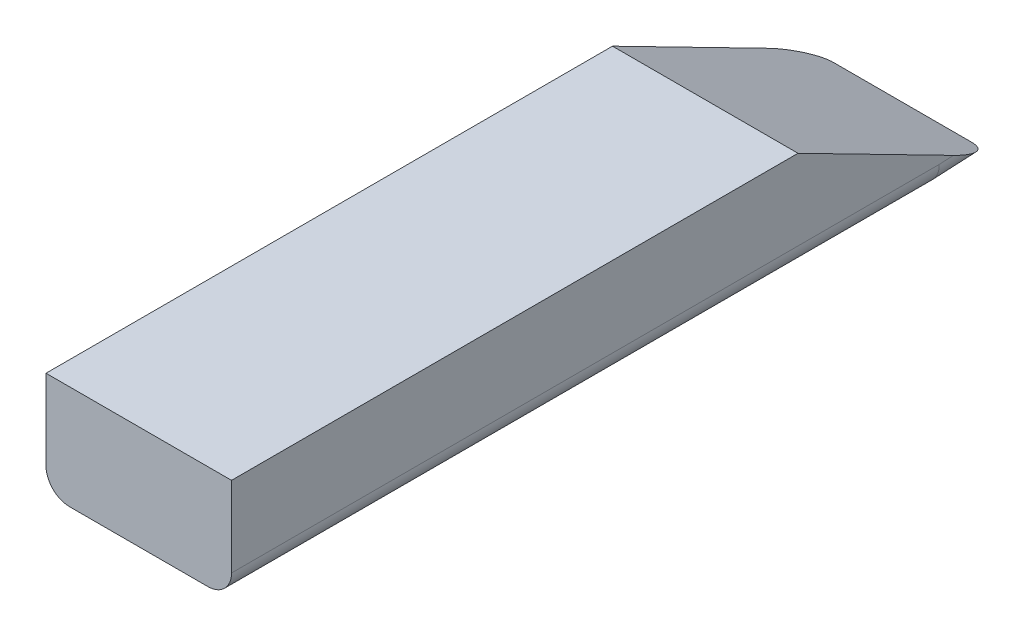
ISO-10303-21;
HEADER;
FILE_DESCRIPTION(('STEP AP214'),'2;1');
FILE_NAME('part.step','',(''),(''),'','','');
FILE_SCHEMA(('AUTOMOTIVE_DESIGN { 1 0 10303 214 1 1 1 1 }'));
ENDSEC;
DATA;
#1=APPLICATION_CONTEXT('core data for automotive mechanical design processes');
#2=APPLICATION_PROTOCOL_DEFINITION('international standard','automotive_design',2000,#1);
#3=PRODUCT_CONTEXT('',#1,'mechanical');
#4=PRODUCT('Part','Part','',(#3));
#5=PRODUCT_RELATED_PRODUCT_CATEGORY('part','',(#4));
#6=PRODUCT_DEFINITION_FORMATION('','',#4);
#7=PRODUCT_DEFINITION_CONTEXT('part definition',#1,'design');
#8=PRODUCT_DEFINITION('design','',#6,#7);
#9=PRODUCT_DEFINITION_SHAPE('','',#8);
#10=(LENGTH_UNIT() NAMED_UNIT(*) SI_UNIT(.MILLI.,.METRE.));
#11=(NAMED_UNIT(*) PLANE_ANGLE_UNIT() SI_UNIT($,.RADIAN.));
#12=(NAMED_UNIT(*) SI_UNIT($,.STERADIAN.) SOLID_ANGLE_UNIT());
#13=UNCERTAINTY_MEASURE_WITH_UNIT(LENGTH_MEASURE(1.E-05),#10,'distance_accuracy_value','');
#14=(GEOMETRIC_REPRESENTATION_CONTEXT(3) GLOBAL_UNCERTAINTY_ASSIGNED_CONTEXT((#13)) GLOBAL_UNIT_ASSIGNED_CONTEXT((#10,
#11,#12)) REPRESENTATION_CONTEXT('',''));
#15=CARTESIAN_POINT('',(0.,0.,0.));
#16=DIRECTION('',(0.,0.,1.));
#17=DIRECTION('',(1.,0.,0.));
#18=AXIS2_PLACEMENT_3D('',#15,#16,#17);
#19=CARTESIAN_POINT('',(49.911,0.,-381.1016));
#20=DIRECTION('',(0.,1.,0.));
#21=DIRECTION('',(0.,0.,1.));
#22=AXIS2_PLACEMENT_3D('',#19,#20,#21);
#23=PLANE('',#22);
#24=DIRECTION('',(-1.,0.,0.));
#25=VECTOR('',#24,1.);
#26=CARTESIAN_POINT('',(49.911,0.,0.));
#27=LINE('',#26,#25);
#28=CARTESIAN_POINT('',(37.211,0.,0.));
#29=VERTEX_POINT('',#28);
#30=CARTESIAN_POINT('',(-37.211,0.,0.));
#31=VERTEX_POINT('',#30);
#32=EDGE_CURVE('E144',#29,#31,#27,.T.);
#33=ORIENTED_EDGE('',*,*,#32,.T.);
#34=DIRECTION('',(0.,0.,-1.));
#35=VECTOR('',#34,1.);
#36=CARTESIAN_POINT('',(-37.211,0.,-381.1016));
#37=LINE('',#36,#35);
#38=CARTESIAN_POINT('',(-37.211,0.,-381.1016));
#39=VERTEX_POINT('',#38);
#40=EDGE_CURVE('E192',#31,#39,#37,.T.);
#41=ORIENTED_EDGE('',*,*,#40,.T.);
#42=DIRECTION('',(-1.,0.,0.));
#43=VECTOR('',#42,1.);
#44=CARTESIAN_POINT('',(49.911,0.,-381.1016));
#45=LINE('',#44,#43);
#46=CARTESIAN_POINT('',(37.211,0.,-381.1016));
#47=VERTEX_POINT('',#46);
#48=EDGE_CURVE('E162',#47,#39,#45,.T.);
#49=ORIENTED_EDGE('',*,*,#48,.F.);
#50=DIRECTION('',(0.,0.,-1.));
#51=VECTOR('',#50,1.);
#52=CARTESIAN_POINT('',(37.211,0.,-381.1016));
#53=LINE('',#52,#51);
#54=EDGE_CURVE('E68',#47,#29,#53,.F.);
#55=ORIENTED_EDGE('',*,*,#54,.T.);
#56=EDGE_LOOP('',(#33,#41,#49,#55));
#57=FACE_BOUND('',#56,.T.);
#58=ADVANCED_FACE('F45',(#57),#23,.F.);
#59=CARTESIAN_POINT('',(49.911,1.51640056220143,-411.035788296217));
#60=DIRECTION('',(0.,0.998719357184186,0.0505929400767125));
#61=DIRECTION('',(0.,-0.0505929400767125,0.998719357184186));
#62=AXIS2_PLACEMENT_3D('',#59,#60,#61);
#63=PLANE('',#62);
#64=DIRECTION('',(-1.,0.,0.));
#65=VECTOR('',#64,1.);
#66=CARTESIAN_POINT('',(49.911,1.51640056220143,-411.035788296217));
#67=LINE('',#66,#65);
#68=CARTESIAN_POINT('',(37.211,1.51640056220143,-411.035788296217));
#69=VERTEX_POINT('',#68);
#70=CARTESIAN_POINT('',(-37.211,1.51640056220143,-411.035788296217));
#71=VERTEX_POINT('',#70);
#72=EDGE_CURVE('E134',#69,#71,#67,.T.);
#73=ORIENTED_EDGE('',*,*,#72,.F.);
#74=DIRECTION('',(0.,0.0505929400767125,-0.998719357184186));
#75=VECTOR('',#74,1.);
#76=CARTESIAN_POINT('',(37.211,1.51640056220143,-411.035788296217));
#77=LINE('',#76,#75);
#78=EDGE_CURVE('E181',#69,#47,#77,.F.);
#79=ORIENTED_EDGE('',*,*,#78,.T.);
#80=ORIENTED_EDGE('',*,*,#48,.T.);
#81=DIRECTION('',(0.,0.0505929400767125,-0.998719357184186));
#82=VECTOR('',#81,1.);
#83=CARTESIAN_POINT('',(-37.211,1.51640056220143,-411.035788296217));
#84=LINE('',#83,#82);
#85=EDGE_CURVE('E177',#39,#71,#84,.T.);
#86=ORIENTED_EDGE('',*,*,#85,.T.);
#87=EDGE_LOOP('',(#73,#79,#80,#86));
#88=FACE_BOUND('',#87,.T.);
#89=ADVANCED_FACE('F222',(#88),#63,.F.);
#90=CARTESIAN_POINT('',(49.911,55.88,-304.8));
#91=DIRECTION('',(0.,-0.89021280461113,0.455544907233509));
#92=DIRECTION('',(0.,-0.455544907233509,-0.89021280461113));
#93=AXIS2_PLACEMENT_3D('',#90,#91,#92);
#94=PLANE('',#93);
#95=DIRECTION('',(0.,0.455544907233509,0.89021280461113));
#96=VECTOR('',#95,1.);
#97=CARTESIAN_POINT('',(49.911,55.88,-304.8));
#98=LINE('',#97,#96);
#99=CARTESIAN_POINT('',(49.911,13.0872412059327,-388.424383059094));
#100=VERTEX_POINT('',#99);
#101=CARTESIAN_POINT('',(49.911,55.88,-304.8));
#102=VERTEX_POINT('',#101);
#103=EDGE_CURVE('E113',#100,#102,#98,.T.);
#104=ORIENTED_EDGE('',*,*,#103,.F.);
#105=CARTESIAN_POINT('',(37.211,13.0872412059327,-388.424383059094));
#106=DIRECTION('',(0.,-0.89021280461113,0.455544907233509));
#107=DIRECTION('',(0.,-0.455544907233509,-0.89021280461113));
#108=AXIS2_PLACEMENT_3D('',#105,#106,#107);
#109=ELLIPSE('',#108,25.4000000000003,12.7);
#110=EDGE_CURVE('E174',#100,#69,#109,.F.);
#111=ORIENTED_EDGE('',*,*,#110,.T.);
#112=ORIENTED_EDGE('',*,*,#72,.T.);
#113=CARTESIAN_POINT('',(-37.211,13.0872412059327,-388.424383059094));
#114=DIRECTION('',(0.,-0.89021280461113,0.455544907233509));
#115=DIRECTION('',(0.,0.455544907233509,0.89021280461113));
#116=AXIS2_PLACEMENT_3D('',#113,#114,#115);
#117=ELLIPSE('',#116,25.4000000000003,12.7);
#118=CARTESIAN_POINT('',(-49.911,13.0872412059327,-388.424383059094));
#119=VERTEX_POINT('',#118);
#120=EDGE_CURVE('E171',#71,#119,#117,.F.);
#121=ORIENTED_EDGE('',*,*,#120,.T.);
#122=DIRECTION('',(0.,0.455544907233509,0.89021280461113));
#123=VECTOR('',#122,1.);
#124=CARTESIAN_POINT('',(-49.911,55.88,-304.8));
#125=LINE('',#124,#123);
#126=CARTESIAN_POINT('',(-49.911,55.88,-304.8));
#127=VERTEX_POINT('',#126);
#128=EDGE_CURVE('E130',#119,#127,#125,.T.);
#129=ORIENTED_EDGE('',*,*,#128,.T.);
#130=DIRECTION('',(-1.,0.,0.));
#131=VECTOR('',#130,1.);
#132=CARTESIAN_POINT('',(49.911,55.88,-304.8));
#133=LINE('',#132,#131);
#134=EDGE_CURVE('E127',#102,#127,#133,.T.);
#135=ORIENTED_EDGE('',*,*,#134,.F.);
#136=EDGE_LOOP('',(#104,#111,#112,#121,#129,#135));
#137=FACE_BOUND('',#136,.T.);
#138=ADVANCED_FACE('F128',(#137),#94,.F.);
#139=CARTESIAN_POINT('',(49.911,55.88,0.));
#140=DIRECTION('',(0.,-1.,0.));
#141=DIRECTION('',(0.,0.,-1.));
#142=AXIS2_PLACEMENT_3D('',#139,#140,#141);
#143=PLANE('',#142);
#144=DIRECTION('',(0.,0.,1.));
#145=VECTOR('',#144,1.);
#146=CARTESIAN_POINT('',(-49.911,55.88,0.));
#147=LINE('',#146,#145);
#148=CARTESIAN_POINT('',(-49.911,55.88,0.));
#149=VERTEX_POINT('',#148);
#150=EDGE_CURVE('E149',#127,#149,#147,.T.);
#151=ORIENTED_EDGE('',*,*,#150,.T.);
#152=DIRECTION('',(-1.,0.,0.));
#153=VECTOR('',#152,1.);
#154=CARTESIAN_POINT('',(49.911,55.88,0.));
#155=LINE('',#154,#153);
#156=CARTESIAN_POINT('',(49.911,55.88,0.));
#157=VERTEX_POINT('',#156);
#158=EDGE_CURVE('E135',#157,#149,#155,.T.);
#159=ORIENTED_EDGE('',*,*,#158,.F.);
#160=DIRECTION('',(0.,0.,1.));
#161=VECTOR('',#160,1.);
#162=CARTESIAN_POINT('',(49.911,55.88,0.));
#163=LINE('',#162,#161);
#164=EDGE_CURVE('E118',#102,#157,#163,.T.);
#165=ORIENTED_EDGE('',*,*,#164,.F.);
#166=ORIENTED_EDGE('',*,*,#134,.T.);
#167=EDGE_LOOP('',(#151,#159,#165,#166));
#168=FACE_BOUND('',#167,.T.);
#169=ADVANCED_FACE('F137',(#168),#143,.F.);
#170=CARTESIAN_POINT('',(49.911,0.,0.));
#171=DIRECTION('',(0.,0.,-1.));
#172=DIRECTION('',(-1.,0.,0.));
#173=AXIS2_PLACEMENT_3D('',#170,#171,#172);
#174=PLANE('',#173);
#175=DIRECTION('',(0.,-1.,0.));
#176=VECTOR('',#175,1.);
#177=CARTESIAN_POINT('',(-49.911,0.,0.));
#178=LINE('',#177,#176);
#179=CARTESIAN_POINT('',(-49.911,12.7,0.));
#180=VERTEX_POINT('',#179);
#181=EDGE_CURVE('E124',#149,#180,#178,.T.);
#182=ORIENTED_EDGE('',*,*,#181,.T.);
#183=CARTESIAN_POINT('',(-37.211,12.7,0.));
#184=DIRECTION('',(0.,0.,-1.));
#185=DIRECTION('',(-1.,0.,0.));
#186=AXIS2_PLACEMENT_3D('',#183,#184,#185);
#187=CIRCLE('',#186,12.7);
#188=EDGE_CURVE('E11',#180,#31,#187,.F.);
#189=ORIENTED_EDGE('',*,*,#188,.T.);
#190=ORIENTED_EDGE('',*,*,#32,.F.);
#191=CARTESIAN_POINT('',(37.211,12.7,0.));
#192=DIRECTION('',(0.,0.,-1.));
#193=DIRECTION('',(-1.,0.,0.));
#194=AXIS2_PLACEMENT_3D('',#191,#192,#193);
#195=CIRCLE('',#194,12.7);
#196=CARTESIAN_POINT('',(49.911,12.7,0.));
#197=VERTEX_POINT('',#196);
#198=EDGE_CURVE('E55',#29,#197,#195,.F.);
#199=ORIENTED_EDGE('',*,*,#198,.T.);
#200=DIRECTION('',(0.,-1.,0.));
#201=VECTOR('',#200,1.);
#202=CARTESIAN_POINT('',(49.911,0.,0.));
#203=LINE('',#202,#201);
#204=EDGE_CURVE('E141',#157,#197,#203,.T.);
#205=ORIENTED_EDGE('',*,*,#204,.F.);
#206=ORIENTED_EDGE('',*,*,#158,.T.);
#207=EDGE_LOOP('',(#182,#189,#190,#199,#205,#206));
#208=FACE_BOUND('',#207,.T.);
#209=ADVANCED_FACE('F214',(#208),#174,.F.);
#210=CARTESIAN_POINT('',(49.911,0.,0.));
#211=DIRECTION('',(-1.,0.,0.));
#212=DIRECTION('',(0.,0.,1.));
#213=AXIS2_PLACEMENT_3D('',#210,#211,#212);
#214=PLANE('',#213);
#215=DIRECTION('',(0.,0.,-1.));
#216=VECTOR('',#215,1.);
#217=CARTESIAN_POINT('',(49.911,12.7,0.));
#218=LINE('',#217,#216);
#219=CARTESIAN_POINT('',(49.911,12.7,-380.78012898574));
#220=VERTEX_POINT('',#219);
#221=EDGE_CURVE('E166',#197,#220,#218,.T.);
#222=ORIENTED_EDGE('',*,*,#221,.T.);
#223=DIRECTION('',(0.,0.0505929400767125,-0.998719357184186));
#224=VECTOR('',#223,1.);
#225=CARTESIAN_POINT('',(49.911,-6.57262243700866,-0.332954689133065));
#226=LINE('',#225,#224);
#227=EDGE_CURVE('E121',#220,#100,#226,.T.);
#228=ORIENTED_EDGE('',*,*,#227,.T.);
#229=ORIENTED_EDGE('',*,*,#103,.T.);
#230=ORIENTED_EDGE('',*,*,#164,.T.);
#231=ORIENTED_EDGE('',*,*,#204,.T.);
#232=EDGE_LOOP('',(#222,#228,#229,#230,#231));
#233=FACE_BOUND('',#232,.T.);
#234=ADVANCED_FACE('F115',(#233),#214,.F.);
#235=CARTESIAN_POINT('',(-49.911,0.,0.));
#236=DIRECTION('',(-1.,0.,0.));
#237=DIRECTION('',(0.,0.,1.));
#238=AXIS2_PLACEMENT_3D('',#235,#236,#237);
#239=PLANE('',#238);
#240=ORIENTED_EDGE('',*,*,#128,.F.);
#241=DIRECTION('',(0.,0.0505929400767125,-0.998719357184186));
#242=VECTOR('',#241,1.);
#243=CARTESIAN_POINT('',(-49.911,12.6837358362392,-380.459069661026));
#244=LINE('',#243,#242);
#245=CARTESIAN_POINT('',(-49.911,12.7,-380.78012898574));
#246=VERTEX_POINT('',#245);
#247=EDGE_CURVE('E187',#119,#246,#244,.F.);
#248=ORIENTED_EDGE('',*,*,#247,.T.);
#249=DIRECTION('',(0.,0.,-1.));
#250=VECTOR('',#249,1.);
#251=CARTESIAN_POINT('',(-49.911,12.7,0.));
#252=LINE('',#251,#250);
#253=EDGE_CURVE('E184',#246,#180,#252,.F.);
#254=ORIENTED_EDGE('',*,*,#253,.T.);
#255=ORIENTED_EDGE('',*,*,#181,.F.);
#256=ORIENTED_EDGE('',*,*,#150,.F.);
#257=EDGE_LOOP('',(#240,#248,#254,#255,#256));
#258=FACE_BOUND('',#257,.T.);
#259=ADVANCED_FACE('F213',(#258),#239,.T.);
#260=CARTESIAN_POINT('',(37.211,12.7,0.));
#261=DIRECTION('',(0.,0.,-1.));
#262=DIRECTION('',(0.,1.,0.));
#263=AXIS2_PLACEMENT_3D('',#260,#261,#262);
#264=CYLINDRICAL_SURFACE('',#263,12.7);
#265=ORIENTED_EDGE('',*,*,#198,.F.);
#266=ORIENTED_EDGE('',*,*,#54,.F.);
#267=CARTESIAN_POINT('',(37.211,12.7,-380.78012898574));
#268=DIRECTION('',(0.,0.0253045728655293,-0.999679788028193));
#269=DIRECTION('',(0.,-0.999679788028193,-0.0253045728655291));
#270=AXIS2_PLACEMENT_3D('',#267,#268,#269);
#271=ELLIPSE('',#270,12.7040679946625,12.7);
#272=EDGE_CURVE('E150',#220,#47,#271,.T.);
#273=ORIENTED_EDGE('',*,*,#272,.F.);
#274=ORIENTED_EDGE('',*,*,#221,.F.);
#275=EDGE_LOOP('',(#265,#266,#273,#274));
#276=FACE_BOUND('',#275,.T.);
#277=ADVANCED_FACE('F218',(#276),#264,.T.);
#278=CARTESIAN_POINT('',(37.211,-6.57262243700866,-0.332954689133065));
#279=DIRECTION('',(0.,0.0505929400767125,-0.998719357184186));
#280=DIRECTION('',(0.,0.998719357184186,0.0505929400767125));
#281=AXIS2_PLACEMENT_3D('',#278,#279,#280);
#282=CYLINDRICAL_SURFACE('',#281,12.7);
#283=ORIENTED_EDGE('',*,*,#272,.T.);
#284=ORIENTED_EDGE('',*,*,#78,.F.);
#285=ORIENTED_EDGE('',*,*,#110,.F.);
#286=ORIENTED_EDGE('',*,*,#227,.F.);
#287=EDGE_LOOP('',(#283,#284,#285,#286));
#288=FACE_BOUND('',#287,.T.);
#289=ADVANCED_FACE('F219',(#288),#282,.T.);
#290=CARTESIAN_POINT('',(-37.211,12.7,-381.1016));
#291=DIRECTION('',(0.,0.,1.));
#292=DIRECTION('',(0.,-1.,0.));
#293=AXIS2_PLACEMENT_3D('',#290,#291,#292);
#294=CYLINDRICAL_SURFACE('',#293,12.7);
#295=ORIENTED_EDGE('',*,*,#188,.F.);
#296=ORIENTED_EDGE('',*,*,#253,.F.);
#297=CARTESIAN_POINT('',(-37.211,12.7,-380.78012898574));
#298=DIRECTION('',(0.,-0.0253045728655293,0.999679788028193));
#299=DIRECTION('',(0.,0.999679788028193,0.0253045728655291));
#300=AXIS2_PLACEMENT_3D('',#297,#298,#299);
#301=ELLIPSE('',#300,12.7040679946625,12.7);
#302=EDGE_CURVE('E49',#39,#246,#301,.F.);
#303=ORIENTED_EDGE('',*,*,#302,.F.);
#304=ORIENTED_EDGE('',*,*,#40,.F.);
#305=EDGE_LOOP('',(#295,#296,#303,#304));
#306=FACE_BOUND('',#305,.T.);
#307=ADVANCED_FACE('F47',(#306),#294,.T.);
#308=CARTESIAN_POINT('',(-37.211,14.2001363984406,-410.393257957242));
#309=DIRECTION('',(0.,-0.0505929400767125,0.998719357184186));
#310=DIRECTION('',(0.,-0.998719357184186,-0.0505929400767125));
#311=AXIS2_PLACEMENT_3D('',#308,#309,#310);
#312=CYLINDRICAL_SURFACE('',#311,12.7);
#313=ORIENTED_EDGE('',*,*,#302,.T.);
#314=ORIENTED_EDGE('',*,*,#247,.F.);
#315=ORIENTED_EDGE('',*,*,#120,.F.);
#316=ORIENTED_EDGE('',*,*,#85,.F.);
#317=EDGE_LOOP('',(#313,#314,#315,#316));
#318=FACE_BOUND('',#317,.T.);
#319=ADVANCED_FACE('F207',(#318),#312,.T.);
#320=CLOSED_SHELL('',(#58,#89,#138,#169,#209,#234,#259,#277,#289,#307,#319));
#321=MANIFOLD_SOLID_BREP('B2',#320);
#322=ADVANCED_BREP_SHAPE_REPRESENTATION('',(#18,#321),#14);
#323=SHAPE_DEFINITION_REPRESENTATION(#9,#322);
ENDSEC;
END-ISO-10303-21;
